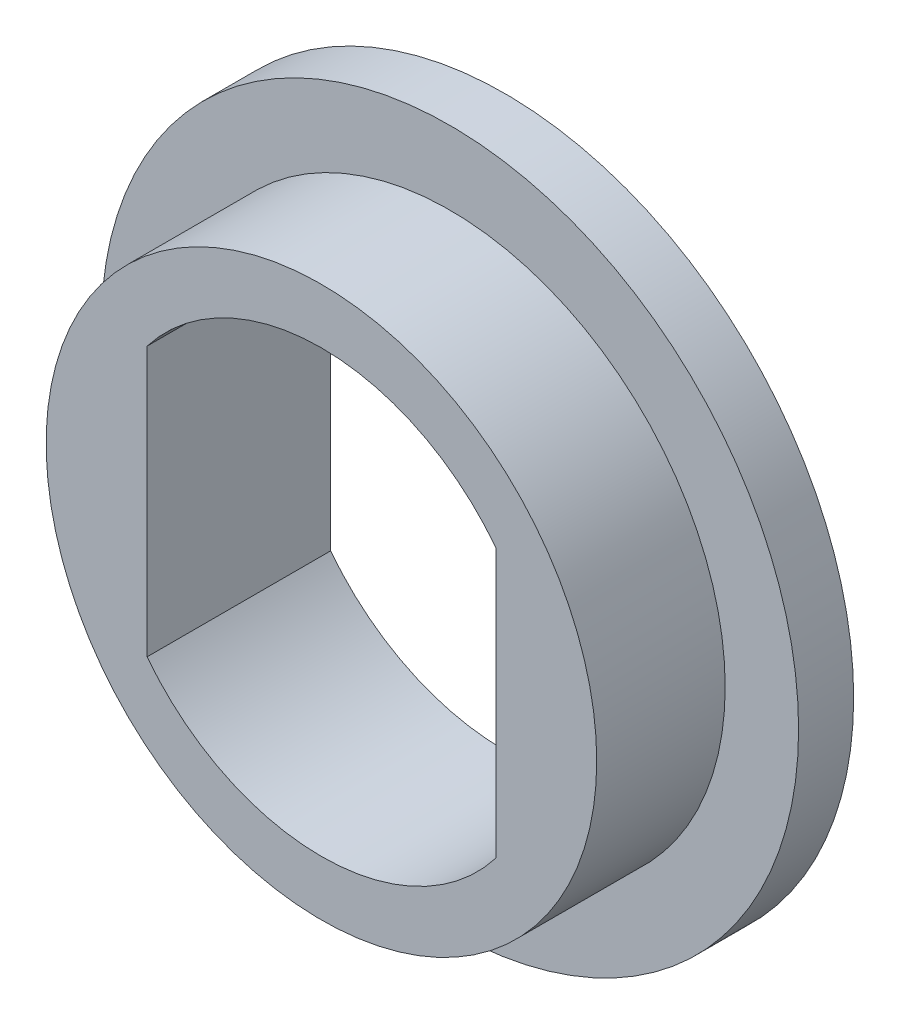
ISO-10303-21;
HEADER;
FILE_DESCRIPTION(('STEP AP214'),'2;1');
FILE_NAME('part.step','',(''),(''),'','','');
FILE_SCHEMA(('AUTOMOTIVE_DESIGN { 1 0 10303 214 1 1 1 1 }'));
ENDSEC;
DATA;
#1=APPLICATION_CONTEXT('core data for automotive mechanical design processes');
#2=APPLICATION_PROTOCOL_DEFINITION('international standard','automotive_design',2000,#1);
#3=PRODUCT_CONTEXT('',#1,'mechanical');
#4=PRODUCT('Part','Part','',(#3));
#5=PRODUCT_RELATED_PRODUCT_CATEGORY('part','',(#4));
#6=PRODUCT_DEFINITION_FORMATION('','',#4);
#7=PRODUCT_DEFINITION_CONTEXT('part definition',#1,'design');
#8=PRODUCT_DEFINITION('design','',#6,#7);
#9=PRODUCT_DEFINITION_SHAPE('','',#8);
#10=(LENGTH_UNIT() NAMED_UNIT(*) SI_UNIT(.MILLI.,.METRE.));
#11=(NAMED_UNIT(*) PLANE_ANGLE_UNIT() SI_UNIT($,.RADIAN.));
#12=(NAMED_UNIT(*) SI_UNIT($,.STERADIAN.) SOLID_ANGLE_UNIT());
#13=UNCERTAINTY_MEASURE_WITH_UNIT(LENGTH_MEASURE(1.E-05),#10,'distance_accuracy_value','');
#14=(GEOMETRIC_REPRESENTATION_CONTEXT(3) GLOBAL_UNCERTAINTY_ASSIGNED_CONTEXT((#13)) GLOBAL_UNIT_ASSIGNED_CONTEXT((#10,
#11,#12)) REPRESENTATION_CONTEXT('',''));
#15=CARTESIAN_POINT('',(0.,0.,0.));
#16=DIRECTION('',(0.,0.,1.));
#17=DIRECTION('',(1.,0.,0.));
#18=AXIS2_PLACEMENT_3D('',#15,#16,#17);
#19=CARTESIAN_POINT('',(0.,0.,7.));
#20=DIRECTION('',(0.,0.,-1.));
#21=DIRECTION('',(-1.,0.,0.));
#22=AXIS2_PLACEMENT_3D('',#19,#20,#21);
#23=CYLINDRICAL_SURFACE('',#22,12.);
#24=DIRECTION('',(0.,0.,-1.));
#25=VECTOR('',#24,1.);
#26=CARTESIAN_POINT('',(9.5,-7.33143914930759,7.));
#27=LINE('',#26,#25);
#28=CARTESIAN_POINT('',(9.5,-7.33143914930759,7.));
#29=VERTEX_POINT('',#28);
#30=CARTESIAN_POINT('',(9.5,-7.33143914930759,-3.));
#31=VERTEX_POINT('',#30);
#32=EDGE_CURVE('E59',#29,#31,#27,.T.);
#33=ORIENTED_EDGE('',*,*,#32,.T.);
#34=CARTESIAN_POINT('',(0.,0.,-3.));
#35=DIRECTION('',(0.,0.,1.));
#36=DIRECTION('',(1.,0.,0.));
#37=AXIS2_PLACEMENT_3D('',#34,#35,#36);
#38=CIRCLE('',#37,12.);
#39=CARTESIAN_POINT('',(-9.5,-7.33143914930759,-3.));
#40=VERTEX_POINT('',#39);
#41=EDGE_CURVE('E95',#40,#31,#38,.T.);
#42=ORIENTED_EDGE('',*,*,#41,.F.);
#43=DIRECTION('',(0.,0.,-1.));
#44=VECTOR('',#43,1.);
#45=CARTESIAN_POINT('',(-9.5,-7.33143914930759,7.));
#46=LINE('',#45,#44);
#47=CARTESIAN_POINT('',(-9.5,-7.33143914930759,7.));
#48=VERTEX_POINT('',#47);
#49=EDGE_CURVE('E11',#48,#40,#46,.T.);
#50=ORIENTED_EDGE('',*,*,#49,.F.);
#51=CARTESIAN_POINT('',(0.,0.,7.));
#52=DIRECTION('',(0.,0.,1.));
#53=DIRECTION('',(1.,0.,0.));
#54=AXIS2_PLACEMENT_3D('',#51,#52,#53);
#55=CIRCLE('',#54,12.);
#56=EDGE_CURVE('E125',#48,#29,#55,.T.);
#57=ORIENTED_EDGE('',*,*,#56,.T.);
#58=EDGE_LOOP('',(#33,#42,#50,#57));
#59=FACE_BOUND('',#58,.T.);
#60=ADVANCED_FACE('F43',(#59),#23,.F.);
#61=CARTESIAN_POINT('',(-9.5,0.,7.));
#62=DIRECTION('',(-1.,0.,0.));
#63=DIRECTION('',(0.,0.,1.));
#64=AXIS2_PLACEMENT_3D('',#61,#62,#63);
#65=PLANE('',#64);
#66=ORIENTED_EDGE('',*,*,#49,.T.);
#67=DIRECTION('',(0.,1.,0.));
#68=VECTOR('',#67,1.);
#69=CARTESIAN_POINT('',(-9.5,0.,-3.));
#70=LINE('',#69,#68);
#71=CARTESIAN_POINT('',(-9.5,7.33143914930759,-3.));
#72=VERTEX_POINT('',#71);
#73=EDGE_CURVE('E90',#40,#72,#70,.T.);
#74=ORIENTED_EDGE('',*,*,#73,.T.);
#75=DIRECTION('',(0.,0.,-1.));
#76=VECTOR('',#75,1.);
#77=CARTESIAN_POINT('',(-9.5,7.33143914930759,7.));
#78=LINE('',#77,#76);
#79=CARTESIAN_POINT('',(-9.5,7.33143914930759,7.));
#80=VERTEX_POINT('',#79);
#81=EDGE_CURVE('E52',#80,#72,#78,.T.);
#82=ORIENTED_EDGE('',*,*,#81,.F.);
#83=DIRECTION('',(0.,1.,0.));
#84=VECTOR('',#83,1.);
#85=CARTESIAN_POINT('',(-9.5,0.,7.));
#86=LINE('',#85,#84);
#87=EDGE_CURVE('E91',#48,#80,#86,.T.);
#88=ORIENTED_EDGE('',*,*,#87,.F.);
#89=EDGE_LOOP('',(#66,#74,#82,#88));
#90=FACE_BOUND('',#89,.T.);
#91=ADVANCED_FACE('F87',(#90),#65,.F.);
#92=CARTESIAN_POINT('',(0.,0.,7.));
#93=DIRECTION('',(0.,0.,-1.));
#94=DIRECTION('',(-1.,0.,0.));
#95=AXIS2_PLACEMENT_3D('',#92,#93,#94);
#96=CYLINDRICAL_SURFACE('',#95,12.);
#97=ORIENTED_EDGE('',*,*,#81,.T.);
#98=CARTESIAN_POINT('',(0.,0.,-3.));
#99=DIRECTION('',(0.,0.,1.));
#100=DIRECTION('',(1.,0.,0.));
#101=AXIS2_PLACEMENT_3D('',#98,#99,#100);
#102=CIRCLE('',#101,12.);
#103=CARTESIAN_POINT('',(9.5,7.33143914930759,-3.));
#104=VERTEX_POINT('',#103);
#105=EDGE_CURVE('E104',#104,#72,#102,.T.);
#106=ORIENTED_EDGE('',*,*,#105,.F.);
#107=DIRECTION('',(0.,0.,-1.));
#108=VECTOR('',#107,1.);
#109=CARTESIAN_POINT('',(9.5,7.33143914930759,7.));
#110=LINE('',#109,#108);
#111=CARTESIAN_POINT('',(9.5,7.33143914930759,7.));
#112=VERTEX_POINT('',#111);
#113=EDGE_CURVE('E67',#112,#104,#110,.T.);
#114=ORIENTED_EDGE('',*,*,#113,.F.);
#115=CARTESIAN_POINT('',(0.,0.,7.));
#116=DIRECTION('',(0.,0.,1.));
#117=DIRECTION('',(1.,0.,0.));
#118=AXIS2_PLACEMENT_3D('',#115,#116,#117);
#119=CIRCLE('',#118,12.);
#120=EDGE_CURVE('E130',#112,#80,#119,.T.);
#121=ORIENTED_EDGE('',*,*,#120,.T.);
#122=EDGE_LOOP('',(#97,#106,#114,#121));
#123=FACE_BOUND('',#122,.T.);
#124=ADVANCED_FACE('F143',(#123),#96,.F.);
#125=CARTESIAN_POINT('',(0.,0.,7.));
#126=DIRECTION('',(0.,0.,-1.));
#127=DIRECTION('',(-1.,0.,0.));
#128=AXIS2_PLACEMENT_3D('',#125,#126,#127);
#129=CYLINDRICAL_SURFACE('',#128,15.);
#130=CARTESIAN_POINT('',(0.,0.,7.));
#131=DIRECTION('',(0.,0.,1.));
#132=DIRECTION('',(1.,0.,0.));
#133=AXIS2_PLACEMENT_3D('',#130,#131,#132);
#134=CIRCLE('',#133,15.);
#135=CARTESIAN_POINT('',(15.,0.,7.));
#136=VERTEX_POINT('',#135);
#137=EDGE_CURVE('E121',#136,#136,#134,.T.);
#138=ORIENTED_EDGE('',*,*,#137,.F.);
#139=EDGE_LOOP('',(#138));
#140=FACE_BOUND('',#139,.T.);
#141=CARTESIAN_POINT('',(0.,0.,0.));
#142=DIRECTION('',(0.,0.,1.));
#143=DIRECTION('',(1.,0.,0.));
#144=AXIS2_PLACEMENT_3D('',#141,#142,#143);
#145=CIRCLE('',#144,15.);
#146=CARTESIAN_POINT('',(15.,0.,0.));
#147=VERTEX_POINT('',#146);
#148=EDGE_CURVE('E117',#147,#147,#145,.T.);
#149=ORIENTED_EDGE('',*,*,#148,.T.);
#150=EDGE_LOOP('',(#149));
#151=FACE_BOUND('',#150,.T.);
#152=ADVANCED_FACE('F45',(#140,#151),#129,.T.);
#153=CARTESIAN_POINT('',(9.5,0.,7.));
#154=DIRECTION('',(-1.,0.,0.));
#155=DIRECTION('',(0.,0.,1.));
#156=AXIS2_PLACEMENT_3D('',#153,#154,#155);
#157=PLANE('',#156);
#158=ORIENTED_EDGE('',*,*,#113,.T.);
#159=DIRECTION('',(0.,1.,0.));
#160=VECTOR('',#159,1.);
#161=CARTESIAN_POINT('',(9.5,0.,-3.));
#162=LINE('',#161,#160);
#163=EDGE_CURVE('E108',#31,#104,#162,.T.);
#164=ORIENTED_EDGE('',*,*,#163,.F.);
#165=ORIENTED_EDGE('',*,*,#32,.F.);
#166=DIRECTION('',(0.,1.,0.));
#167=VECTOR('',#166,1.);
#168=CARTESIAN_POINT('',(9.5,0.,7.));
#169=LINE('',#168,#167);
#170=EDGE_CURVE('E133',#29,#112,#169,.T.);
#171=ORIENTED_EDGE('',*,*,#170,.T.);
#172=EDGE_LOOP('',(#158,#164,#165,#171));
#173=FACE_BOUND('',#172,.T.);
#174=ADVANCED_FACE('F147',(#173),#157,.T.);
#175=CARTESIAN_POINT('',(0.,0.,7.));
#176=DIRECTION('',(0.,0.,1.));
#177=DIRECTION('',(1.,0.,0.));
#178=AXIS2_PLACEMENT_3D('',#175,#176,#177);
#179=PLANE('',#178);
#180=ORIENTED_EDGE('',*,*,#137,.T.);
#181=EDGE_LOOP('',(#180));
#182=FACE_BOUND('',#181,.T.);
#183=ORIENTED_EDGE('',*,*,#56,.F.);
#184=ORIENTED_EDGE('',*,*,#87,.T.);
#185=ORIENTED_EDGE('',*,*,#120,.F.);
#186=ORIENTED_EDGE('',*,*,#170,.F.);
#187=EDGE_LOOP('',(#183,#184,#185,#186));
#188=FACE_BOUND('',#187,.T.);
#189=ADVANCED_FACE('F146',(#182,#188),#179,.T.);
#190=CARTESIAN_POINT('',(0.,0.,-3.));
#191=DIRECTION('',(0.,0.,1.));
#192=DIRECTION('',(1.,0.,0.));
#193=AXIS2_PLACEMENT_3D('',#190,#191,#192);
#194=CYLINDRICAL_SURFACE('',#193,19.);
#195=CARTESIAN_POINT('',(0.,0.,-3.));
#196=DIRECTION('',(0.,0.,1.));
#197=DIRECTION('',(1.,0.,0.));
#198=AXIS2_PLACEMENT_3D('',#195,#196,#197);
#199=CIRCLE('',#198,19.);
#200=CARTESIAN_POINT('',(19.,0.,-3.));
#201=VERTEX_POINT('',#200);
#202=EDGE_CURVE('E113',#201,#201,#199,.T.);
#203=ORIENTED_EDGE('',*,*,#202,.T.);
#204=EDGE_LOOP('',(#203));
#205=FACE_BOUND('',#204,.T.);
#206=CARTESIAN_POINT('',(0.,0.,0.));
#207=DIRECTION('',(0.,0.,1.));
#208=DIRECTION('',(1.,0.,0.));
#209=AXIS2_PLACEMENT_3D('',#206,#207,#208);
#210=CIRCLE('',#209,19.);
#211=CARTESIAN_POINT('',(19.,0.,0.));
#212=VERTEX_POINT('',#211);
#213=EDGE_CURVE('E99',#212,#212,#210,.T.);
#214=ORIENTED_EDGE('',*,*,#213,.F.);
#215=EDGE_LOOP('',(#214));
#216=FACE_BOUND('',#215,.T.);
#217=ADVANCED_FACE('F154',(#205,#216),#194,.T.);
#218=CARTESIAN_POINT('',(0.,0.,-3.));
#219=DIRECTION('',(0.,0.,1.));
#220=DIRECTION('',(1.,0.,0.));
#221=AXIS2_PLACEMENT_3D('',#218,#219,#220);
#222=PLANE('',#221);
#223=ORIENTED_EDGE('',*,*,#41,.T.);
#224=ORIENTED_EDGE('',*,*,#163,.T.);
#225=ORIENTED_EDGE('',*,*,#105,.T.);
#226=ORIENTED_EDGE('',*,*,#73,.F.);
#227=EDGE_LOOP('',(#223,#224,#225,#226));
#228=FACE_BOUND('',#227,.T.);
#229=ORIENTED_EDGE('',*,*,#202,.F.);
#230=EDGE_LOOP('',(#229));
#231=FACE_BOUND('',#230,.T.);
#232=ADVANCED_FACE('F102',(#228,#231),#222,.F.);
#233=CARTESIAN_POINT('',(0.,0.,0.));
#234=DIRECTION('',(0.,0.,1.));
#235=DIRECTION('',(1.,0.,0.));
#236=AXIS2_PLACEMENT_3D('',#233,#234,#235);
#237=PLANE('',#236);
#238=ORIENTED_EDGE('',*,*,#148,.F.);
#239=EDGE_LOOP('',(#238));
#240=FACE_BOUND('',#239,.T.);
#241=ORIENTED_EDGE('',*,*,#213,.T.);
#242=EDGE_LOOP('',(#241));
#243=FACE_BOUND('',#242,.T.);
#244=ADVANCED_FACE('F223',(#240,#243),#237,.T.);
#245=CLOSED_SHELL('',(#60,#91,#124,#152,#174,#189,#217,#232,#244));
#246=MANIFOLD_SOLID_BREP('B2',#245);
#247=ADVANCED_BREP_SHAPE_REPRESENTATION('',(#18,#246),#14);
#248=SHAPE_DEFINITION_REPRESENTATION(#9,#247);
ENDSEC;
END-ISO-10303-21;
